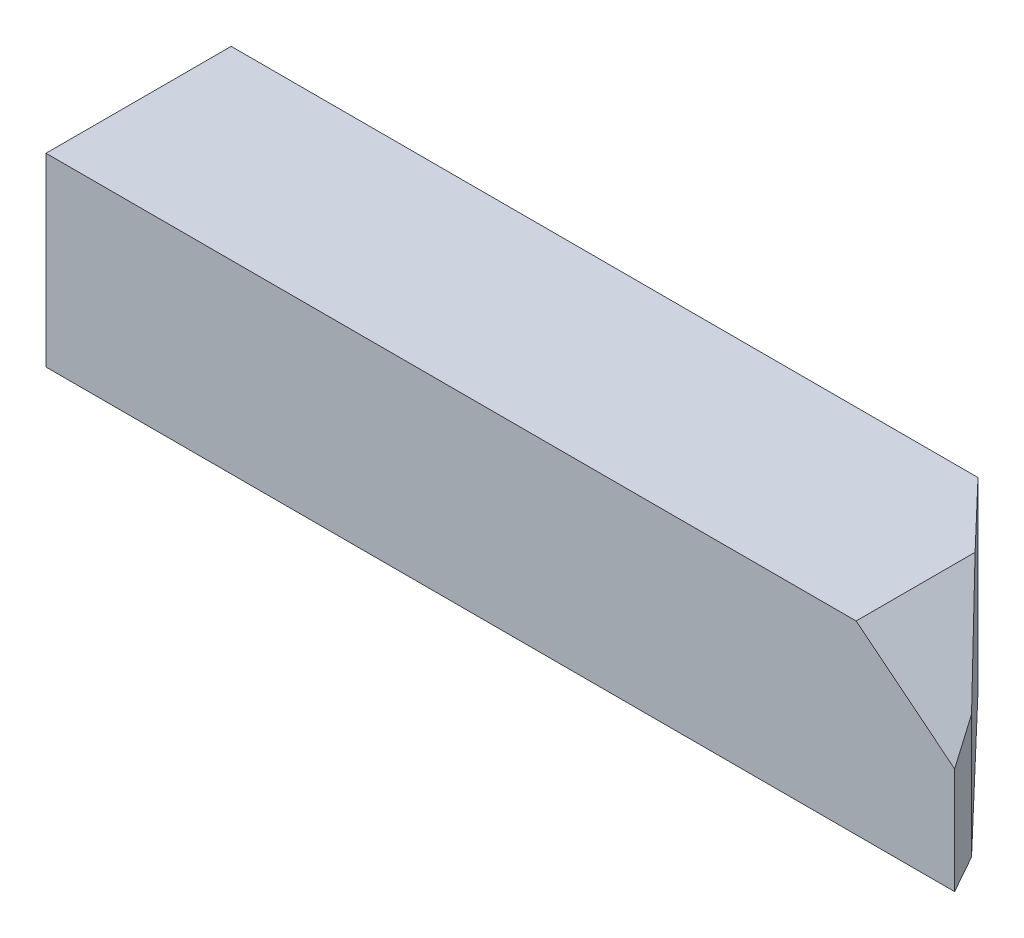
ISO-10303-21;
HEADER;
FILE_DESCRIPTION(('STEP AP214'),'2;1');
FILE_NAME('part.step','',(''),(''),'','','');
FILE_SCHEMA(('AUTOMOTIVE_DESIGN { 1 0 10303 214 1 1 1 1 }'));
ENDSEC;
DATA;
#1=APPLICATION_CONTEXT('core data for automotive mechanical design processes');
#2=APPLICATION_PROTOCOL_DEFINITION('international standard','automotive_design',2000,#1);
#3=PRODUCT_CONTEXT('',#1,'mechanical');
#4=PRODUCT('Part','Part','',(#3));
#5=PRODUCT_RELATED_PRODUCT_CATEGORY('part','',(#4));
#6=PRODUCT_DEFINITION_FORMATION('','',#4);
#7=PRODUCT_DEFINITION_CONTEXT('part definition',#1,'design');
#8=PRODUCT_DEFINITION('design','',#6,#7);
#9=PRODUCT_DEFINITION_SHAPE('','',#8);
#10=(LENGTH_UNIT() NAMED_UNIT(*) SI_UNIT(.MILLI.,.METRE.));
#11=(NAMED_UNIT(*) PLANE_ANGLE_UNIT() SI_UNIT($,.RADIAN.));
#12=(NAMED_UNIT(*) SI_UNIT($,.STERADIAN.) SOLID_ANGLE_UNIT());
#13=UNCERTAINTY_MEASURE_WITH_UNIT(LENGTH_MEASURE(1.E-05),#10,'distance_accuracy_value','');
#14=(GEOMETRIC_REPRESENTATION_CONTEXT(3) GLOBAL_UNCERTAINTY_ASSIGNED_CONTEXT((#13)) GLOBAL_UNIT_ASSIGNED_CONTEXT((#10,
#11,#12)) REPRESENTATION_CONTEXT('',''));
#15=CARTESIAN_POINT('',(0.,0.,0.));
#16=DIRECTION('',(0.,0.,1.));
#17=DIRECTION('',(1.,0.,0.));
#18=AXIS2_PLACEMENT_3D('',#15,#16,#17);
#19=CARTESIAN_POINT('',(39.2561069952708,0.,8.));
#20=DIRECTION('',(0.,1.,0.));
#21=DIRECTION('',(-1.,0.,0.));
#22=AXIS2_PLACEMENT_3D('',#19,#20,#21);
#23=PLANE('',#22);
#24=DIRECTION('',(1.,0.,0.));
#25=VECTOR('',#24,1.);
#26=CARTESIAN_POINT('',(39.2561069952708,0.,0.));
#27=LINE('',#26,#25);
#28=CARTESIAN_POINT('',(0.,0.,0.));
#29=VERTEX_POINT('',#28);
#30=CARTESIAN_POINT('',(32.2655592800084,0.,0.));
#31=VERTEX_POINT('',#30);
#32=EDGE_CURVE('E115',#29,#31,#27,.T.);
#33=ORIENTED_EDGE('',*,*,#32,.T.);
#34=DIRECTION('',(-0.691009544232569,0.,-0.722845633437387));
#35=VECTOR('',#34,1.);
#36=CARTESIAN_POINT('',(38.3251835037329,0.,6.3388023319639));
#37=LINE('',#36,#35);
#38=CARTESIAN_POINT('',(38.3251835037329,0.,6.3388023319639));
#39=VERTEX_POINT('',#38);
#40=EDGE_CURVE('E51',#39,#31,#37,.T.);
#41=ORIENTED_EDGE('',*,*,#40,.F.);
#42=DIRECTION('',(-0.488864316513568,0.,-0.872359834036232));
#43=VECTOR('',#42,1.);
#44=CARTESIAN_POINT('',(39.2561069952708,0.,8.));
#45=LINE('',#44,#43);
#46=CARTESIAN_POINT('',(39.2561069952708,0.,8.));
#47=VERTEX_POINT('',#46);
#48=EDGE_CURVE('E112',#47,#39,#45,.T.);
#49=ORIENTED_EDGE('',*,*,#48,.F.);
#50=DIRECTION('',(1.,0.,0.));
#51=VECTOR('',#50,1.);
#52=CARTESIAN_POINT('',(39.2561069952708,0.,8.));
#53=LINE('',#52,#51);
#54=CARTESIAN_POINT('',(0.,0.,8.));
#55=VERTEX_POINT('',#54);
#56=EDGE_CURVE('E117',#55,#47,#53,.T.);
#57=ORIENTED_EDGE('',*,*,#56,.F.);
#58=DIRECTION('',(0.,0.,-1.));
#59=VECTOR('',#58,1.);
#60=CARTESIAN_POINT('',(0.,0.,8.));
#61=LINE('',#60,#59);
#62=EDGE_CURVE('E123',#55,#29,#61,.T.);
#63=ORIENTED_EDGE('',*,*,#62,.T.);
#64=EDGE_LOOP('',(#33,#41,#49,#57,#63));
#65=FACE_BOUND('',#64,.T.);
#66=ADVANCED_FACE('F37',(#65),#23,.F.);
#67=CARTESIAN_POINT('',(35.,8.,8.));
#68=DIRECTION('',(-0.624695047554421,-0.780868809443033,0.));
#69=DIRECTION('',(0.780868809443033,-0.624695047554421,0.));
#70=AXIS2_PLACEMENT_3D('',#67,#68,#69);
#71=PLANE('',#70);
#72=DIRECTION('',(-0.45528424906204,0.364227399249628,-0.812437477097079));
#73=VECTOR('',#72,1.);
#74=CARTESIAN_POINT('',(37.8092632309671,5.75258941522638,5.41816217001525));
#75=LINE('',#74,#73);
#76=CARTESIAN_POINT('',(39.2561069952708,4.5951144037834,8.));
#77=VERTEX_POINT('',#76);
#78=CARTESIAN_POINT('',(38.3251835037329,5.33985319701369,6.3388023319639));
#79=VERTEX_POINT('',#78);
#80=EDGE_CURVE('E119',#77,#79,#75,.T.);
#81=ORIENTED_EDGE('',*,*,#80,.T.);
#82=DIRECTION('',(-0.604755175314995,0.483804140251991,-0.632617366031601));
#83=VECTOR('',#82,1.);
#84=CARTESIAN_POINT('',(36.9662928938337,6.42696568493303,4.91730511548826));
#85=LINE('',#84,#83);
#86=CARTESIAN_POINT('',(35.,8.,2.86042146716587));
#87=VERTEX_POINT('',#86);
#88=EDGE_CURVE('E134',#79,#87,#85,.T.);
#89=ORIENTED_EDGE('',*,*,#88,.T.);
#90=DIRECTION('',(0.,0.,-1.));
#91=VECTOR('',#90,1.);
#92=CARTESIAN_POINT('',(35.,8.,8.));
#93=LINE('',#92,#91);
#94=CARTESIAN_POINT('',(35.,8.,8.));
#95=VERTEX_POINT('',#94);
#96=EDGE_CURVE('E11',#95,#87,#93,.T.);
#97=ORIENTED_EDGE('',*,*,#96,.F.);
#98=DIRECTION('',(-0.780868809443033,0.624695047554421,0.));
#99=VECTOR('',#98,1.);
#100=CARTESIAN_POINT('',(35.,8.,8.));
#101=LINE('',#100,#99);
#102=EDGE_CURVE('E79',#77,#95,#101,.T.);
#103=ORIENTED_EDGE('',*,*,#102,.F.);
#104=EDGE_LOOP('',(#81,#89,#97,#103));
#105=FACE_BOUND('',#104,.T.);
#106=ADVANCED_FACE('F147',(#105),#71,.F.);
#107=CARTESIAN_POINT('',(0.,8.,8.));
#108=DIRECTION('',(0.,-1.,0.));
#109=DIRECTION('',(0.,0.,-1.));
#110=AXIS2_PLACEMENT_3D('',#107,#108,#109);
#111=PLANE('',#110);
#112=ORIENTED_EDGE('',*,*,#96,.T.);
#113=DIRECTION('',(-0.691009544232569,0.,-0.722845633437387));
#114=VECTOR('',#113,1.);
#115=CARTESIAN_POINT('',(38.3251835037329,8.,6.3388023319639));
#116=LINE('',#115,#114);
#117=CARTESIAN_POINT('',(32.2655592800084,8.,0.));
#118=VERTEX_POINT('',#117);
#119=EDGE_CURVE('E99',#87,#118,#116,.T.);
#120=ORIENTED_EDGE('',*,*,#119,.T.);
#121=DIRECTION('',(-1.,0.,0.));
#122=VECTOR('',#121,1.);
#123=CARTESIAN_POINT('',(0.,8.,0.));
#124=LINE('',#123,#122);
#125=CARTESIAN_POINT('',(0.,8.,0.));
#126=VERTEX_POINT('',#125);
#127=EDGE_CURVE('E110',#118,#126,#124,.T.);
#128=ORIENTED_EDGE('',*,*,#127,.T.);
#129=DIRECTION('',(0.,0.,-1.));
#130=VECTOR('',#129,1.);
#131=CARTESIAN_POINT('',(0.,8.,8.));
#132=LINE('',#131,#130);
#133=CARTESIAN_POINT('',(0.,8.,8.));
#134=VERTEX_POINT('',#133);
#135=EDGE_CURVE('E44',#134,#126,#132,.T.);
#136=ORIENTED_EDGE('',*,*,#135,.F.);
#137=DIRECTION('',(-1.,0.,0.));
#138=VECTOR('',#137,1.);
#139=CARTESIAN_POINT('',(0.,8.,8.));
#140=LINE('',#139,#138);
#141=EDGE_CURVE('E125',#95,#134,#140,.T.);
#142=ORIENTED_EDGE('',*,*,#141,.F.);
#143=EDGE_LOOP('',(#112,#120,#128,#136,#142));
#144=FACE_BOUND('',#143,.T.);
#145=ADVANCED_FACE('F108',(#144),#111,.F.);
#146=CARTESIAN_POINT('',(0.,0.,8.));
#147=DIRECTION('',(1.,0.,0.));
#148=DIRECTION('',(0.,0.,-1.));
#149=AXIS2_PLACEMENT_3D('',#146,#147,#148);
#150=PLANE('',#149);
#151=DIRECTION('',(0.,-1.,0.));
#152=VECTOR('',#151,1.);
#153=CARTESIAN_POINT('',(0.,0.,0.));
#154=LINE('',#153,#152);
#155=EDGE_CURVE('E74',#126,#29,#154,.T.);
#156=ORIENTED_EDGE('',*,*,#155,.T.);
#157=ORIENTED_EDGE('',*,*,#62,.F.);
#158=DIRECTION('',(0.,-1.,0.));
#159=VECTOR('',#158,1.);
#160=CARTESIAN_POINT('',(0.,0.,8.));
#161=LINE('',#160,#159);
#162=EDGE_CURVE('E60',#134,#55,#161,.T.);
#163=ORIENTED_EDGE('',*,*,#162,.F.);
#164=ORIENTED_EDGE('',*,*,#135,.T.);
#165=EDGE_LOOP('',(#156,#157,#163,#164));
#166=FACE_BOUND('',#165,.T.);
#167=ADVANCED_FACE('F124',(#166),#150,.F.);
#168=CARTESIAN_POINT('',(0.,0.,8.));
#169=DIRECTION('',(0.,0.,-1.));
#170=DIRECTION('',(-1.,0.,0.));
#171=AXIS2_PLACEMENT_3D('',#168,#169,#170);
#172=PLANE('',#171);
#173=ORIENTED_EDGE('',*,*,#56,.T.);
#174=DIRECTION('',(0.,1.,0.));
#175=VECTOR('',#174,1.);
#176=CARTESIAN_POINT('',(39.2561069952708,4.5951144037834,8.));
#177=LINE('',#176,#175);
#178=EDGE_CURVE('E127',#47,#77,#177,.T.);
#179=ORIENTED_EDGE('',*,*,#178,.T.);
#180=ORIENTED_EDGE('',*,*,#102,.T.);
#181=ORIENTED_EDGE('',*,*,#141,.T.);
#182=ORIENTED_EDGE('',*,*,#162,.T.);
#183=EDGE_LOOP('',(#173,#179,#180,#181,#182));
#184=FACE_BOUND('',#183,.T.);
#185=ADVANCED_FACE('F145',(#184),#172,.F.);
#186=CARTESIAN_POINT('',(0.,0.,0.));
#187=DIRECTION('',(0.,0.,-1.));
#188=DIRECTION('',(-1.,0.,0.));
#189=AXIS2_PLACEMENT_3D('',#186,#187,#188);
#190=PLANE('',#189);
#191=DIRECTION('',(0.,-1.,0.));
#192=VECTOR('',#191,1.);
#193=CARTESIAN_POINT('',(32.2655592800084,8.,0.));
#194=LINE('',#193,#192);
#195=EDGE_CURVE('E96',#118,#31,#194,.T.);
#196=ORIENTED_EDGE('',*,*,#195,.T.);
#197=ORIENTED_EDGE('',*,*,#32,.F.);
#198=ORIENTED_EDGE('',*,*,#155,.F.);
#199=ORIENTED_EDGE('',*,*,#127,.F.);
#200=EDGE_LOOP('',(#196,#197,#198,#199));
#201=FACE_BOUND('',#200,.T.);
#202=ADVANCED_FACE('F114',(#201),#190,.T.);
#203=CARTESIAN_POINT('',(39.2561069952708,8.,8.));
#204=DIRECTION('',(-0.872359834036232,0.,0.488864316513568));
#205=DIRECTION('',(0.488864316513568,0.,0.872359834036232));
#206=AXIS2_PLACEMENT_3D('',#203,#204,#205);
#207=PLANE('',#206);
#208=ORIENTED_EDGE('',*,*,#178,.F.);
#209=ORIENTED_EDGE('',*,*,#48,.T.);
#210=DIRECTION('',(0.,-1.,0.));
#211=VECTOR('',#210,1.);
#212=CARTESIAN_POINT('',(38.3251835037329,8.,6.3388023319639));
#213=LINE('',#212,#211);
#214=EDGE_CURVE('E105',#79,#39,#213,.T.);
#215=ORIENTED_EDGE('',*,*,#214,.F.);
#216=ORIENTED_EDGE('',*,*,#80,.F.);
#217=EDGE_LOOP('',(#208,#209,#215,#216));
#218=FACE_BOUND('',#217,.T.);
#219=ADVANCED_FACE('F142',(#218),#207,.F.);
#220=CARTESIAN_POINT('',(38.3251835037329,8.,6.3388023319639));
#221=DIRECTION('',(-0.722845633437387,0.,0.691009544232569));
#222=DIRECTION('',(0.691009544232569,0.,0.722845633437387));
#223=AXIS2_PLACEMENT_3D('',#220,#221,#222);
#224=PLANE('',#223);
#225=ORIENTED_EDGE('',*,*,#214,.T.);
#226=ORIENTED_EDGE('',*,*,#40,.T.);
#227=ORIENTED_EDGE('',*,*,#195,.F.);
#228=ORIENTED_EDGE('',*,*,#119,.F.);
#229=ORIENTED_EDGE('',*,*,#88,.F.);
#230=EDGE_LOOP('',(#225,#226,#227,#228,#229));
#231=FACE_BOUND('',#230,.T.);
#232=ADVANCED_FACE('F98',(#231),#224,.F.);
#233=CLOSED_SHELL('',(#66,#106,#145,#167,#185,#202,#219,#232));
#234=MANIFOLD_SOLID_BREP('B2',#233);
#235=ADVANCED_BREP_SHAPE_REPRESENTATION('',(#18,#234),#14);
#236=SHAPE_DEFINITION_REPRESENTATION(#9,#235);
ENDSEC;
END-ISO-10303-21;
